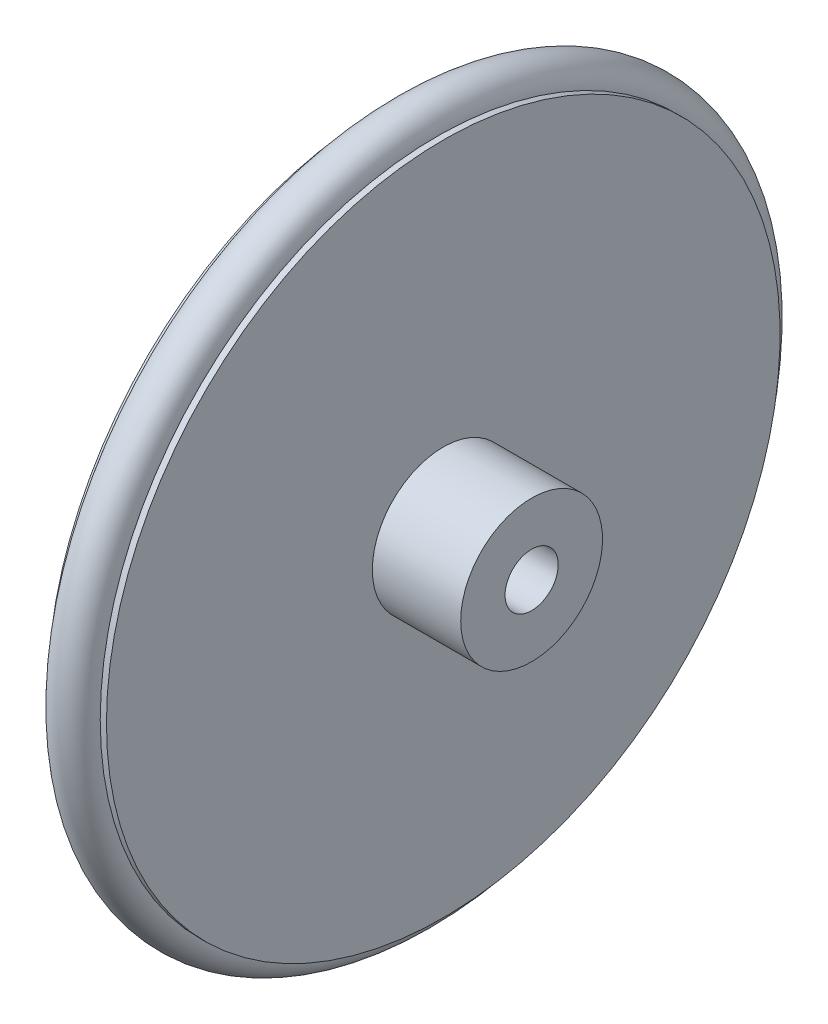
ISO-10303-21;
HEADER;
FILE_DESCRIPTION(('STEP AP214'),'2;1');
FILE_NAME('part.step','',(''),(''),'','','');
FILE_SCHEMA(('AUTOMOTIVE_DESIGN { 1 0 10303 214 1 1 1 1 }'));
ENDSEC;
DATA;
#1=APPLICATION_CONTEXT('core data for automotive mechanical design processes');
#2=APPLICATION_PROTOCOL_DEFINITION('international standard','automotive_design',2000,#1);
#3=PRODUCT_CONTEXT('',#1,'mechanical');
#4=PRODUCT('Part','Part','',(#3));
#5=PRODUCT_RELATED_PRODUCT_CATEGORY('part','',(#4));
#6=PRODUCT_DEFINITION_FORMATION('','',#4);
#7=PRODUCT_DEFINITION_CONTEXT('part definition',#1,'design');
#8=PRODUCT_DEFINITION('design','',#6,#7);
#9=PRODUCT_DEFINITION_SHAPE('','',#8);
#10=(LENGTH_UNIT() NAMED_UNIT(*) SI_UNIT(.MILLI.,.METRE.));
#11=(NAMED_UNIT(*) PLANE_ANGLE_UNIT() SI_UNIT($,.RADIAN.));
#12=(NAMED_UNIT(*) SI_UNIT($,.STERADIAN.) SOLID_ANGLE_UNIT());
#13=UNCERTAINTY_MEASURE_WITH_UNIT(LENGTH_MEASURE(1.E-05),#10,'distance_accuracy_value','');
#14=(GEOMETRIC_REPRESENTATION_CONTEXT(3) GLOBAL_UNCERTAINTY_ASSIGNED_CONTEXT((#13)) GLOBAL_UNIT_ASSIGNED_CONTEXT((#10,
#11,#12)) REPRESENTATION_CONTEXT('',''));
#15=CARTESIAN_POINT('',(0.,0.,0.));
#16=DIRECTION('',(0.,0.,1.));
#17=DIRECTION('',(1.,0.,0.));
#18=AXIS2_PLACEMENT_3D('',#15,#16,#17);
#19=CARTESIAN_POINT('',(3.30000000000003,0.,0.));
#20=DIRECTION('',(-1.,0.,0.));
#21=DIRECTION('',(0.,0.,1.));
#22=AXIS2_PLACEMENT_3D('',#19,#20,#21);
#23=TOROIDAL_SURFACE('',#22,38.,2.5);
#24=CARTESIAN_POINT('',(3.30000000000003,38.,0.));
#25=DIRECTION('',(0.,0.,1.));
#26=DIRECTION('',(1.,0.,0.));
#27=AXIS2_PLACEMENT_3D('',#24,#25,#26);
#28=CIRCLE('',#27,2.5);
#29=CARTESIAN_POINT('',(3.30000000000003,40.5,0.));
#30=VERTEX_POINT('',#29);
#31=EDGE_CURVE('E11',#30,#30,#28,.T.);
#32=CARTESIAN_POINT('',(3.30000000000003,0.,0.));
#33=DIRECTION('',(-1.,0.,0.));
#34=DIRECTION('',(0.,0.,1.));
#35=AXIS2_PLACEMENT_3D('',#32,#33,#34);
#36=CIRCLE('',#35,40.5);
#37=EDGE_CURVE('',#30,#30,#36,.T.);
#38=ORIENTED_EDGE('',*,*,#31,.F.);
#39=ORIENTED_EDGE('',*,*,#31,.T.);
#40=ORIENTED_EDGE('',*,*,#37,.T.);
#41=ORIENTED_EDGE('',*,*,#37,.F.);
#42=EDGE_LOOP('',(#38,#40,#39,#41));
#43=FACE_BOUND('',#42,.T.);
#44=ADVANCED_FACE('F44',(#43),#23,.T.);
#45=CLOSED_SHELL('',(#44));
#46=MANIFOLD_SOLID_BREP('B2',#45);
#47=CARTESIAN_POINT('',(0.,38.,0.));
#48=DIRECTION('',(1.,0.,0.));
#49=DIRECTION('',(0.,0.,-1.));
#50=AXIS2_PLACEMENT_3D('',#47,#48,#49);
#51=PLANE('',#50);
#52=CARTESIAN_POINT('',(0.,0.,0.));
#53=DIRECTION('',(1.,0.,0.));
#54=DIRECTION('',(0.,0.,-1.));
#55=AXIS2_PLACEMENT_3D('',#52,#53,#54);
#56=CIRCLE('',#55,3.);
#57=CARTESIAN_POINT('',(0.,0.,-3.));
#58=VERTEX_POINT('',#57);
#59=EDGE_CURVE('E105',#58,#58,#56,.T.);
#60=ORIENTED_EDGE('',*,*,#59,.T.);
#61=EDGE_LOOP('',(#60));
#62=FACE_BOUND('',#61,.T.);
#63=CARTESIAN_POINT('',(0.,0.,0.));
#64=DIRECTION('',(-1.,0.,0.));
#65=DIRECTION('',(0.,0.,1.));
#66=AXIS2_PLACEMENT_3D('',#63,#64,#65);
#67=CIRCLE('',#66,38.);
#68=CARTESIAN_POINT('',(0.,0.,38.));
#69=VERTEX_POINT('',#68);
#70=EDGE_CURVE('E102',#69,#69,#67,.T.);
#71=ORIENTED_EDGE('',*,*,#70,.T.);
#72=EDGE_LOOP('',(#71));
#73=FACE_BOUND('',#72,.T.);
#74=ADVANCED_FACE('F74',(#62,#73),#51,.F.);
#75=CARTESIAN_POINT('',(16.57,0.,0.));
#76=DIRECTION('',(-1.,0.,0.));
#77=DIRECTION('',(0.,0.,1.));
#78=AXIS2_PLACEMENT_3D('',#75,#76,#77);
#79=PLANE('',#78);
#80=CARTESIAN_POINT('',(16.57,0.,0.));
#81=DIRECTION('',(1.,0.,0.));
#82=DIRECTION('',(0.,0.,-1.));
#83=AXIS2_PLACEMENT_3D('',#80,#81,#82);
#84=CIRCLE('',#83,3.);
#85=CARTESIAN_POINT('',(16.57,0.,-3.));
#86=VERTEX_POINT('',#85);
#87=EDGE_CURVE('E106',#86,#86,#84,.T.);
#88=ORIENTED_EDGE('',*,*,#87,.F.);
#89=EDGE_LOOP('',(#88));
#90=FACE_BOUND('',#89,.T.);
#91=CARTESIAN_POINT('',(16.57,0.,0.));
#92=DIRECTION('',(-1.,0.,0.));
#93=DIRECTION('',(0.,0.,1.));
#94=AXIS2_PLACEMENT_3D('',#91,#92,#93);
#95=CIRCLE('',#94,8.);
#96=CARTESIAN_POINT('',(16.57,0.,8.));
#97=VERTEX_POINT('',#96);
#98=EDGE_CURVE('E43',#97,#97,#95,.T.);
#99=ORIENTED_EDGE('',*,*,#98,.F.);
#100=EDGE_LOOP('',(#99));
#101=FACE_BOUND('',#100,.T.);
#102=ADVANCED_FACE('F121',(#90,#101),#79,.F.);
#103=CARTESIAN_POINT('',(-19.9450853035614,0.,0.));
#104=DIRECTION('',(-1.,0.,0.));
#105=DIRECTION('',(0.,0.,1.));
#106=AXIS2_PLACEMENT_3D('',#103,#104,#105);
#107=CYLINDRICAL_SURFACE('',#106,8.);
#108=CARTESIAN_POINT('',(6.6,0.,0.));
#109=DIRECTION('',(-1.,0.,0.));
#110=DIRECTION('',(0.,0.,1.));
#111=AXIS2_PLACEMENT_3D('',#108,#109,#110);
#112=CIRCLE('',#111,8.);
#113=CARTESIAN_POINT('',(6.6,0.,8.));
#114=VERTEX_POINT('',#113);
#115=EDGE_CURVE('E80',#114,#114,#112,.T.);
#116=ORIENTED_EDGE('',*,*,#115,.F.);
#117=EDGE_LOOP('',(#116));
#118=FACE_BOUND('',#117,.T.);
#119=ORIENTED_EDGE('',*,*,#98,.T.);
#120=EDGE_LOOP('',(#119));
#121=FACE_BOUND('',#120,.T.);
#122=ADVANCED_FACE('F124',(#118,#121),#107,.T.);
#123=CARTESIAN_POINT('',(6.6,8.,0.));
#124=DIRECTION('',(-1.,0.,0.));
#125=DIRECTION('',(0.,0.,1.));
#126=AXIS2_PLACEMENT_3D('',#123,#124,#125);
#127=PLANE('',#126);
#128=CARTESIAN_POINT('',(6.6,0.,0.));
#129=DIRECTION('',(-1.,0.,0.));
#130=DIRECTION('',(0.,0.,1.));
#131=AXIS2_PLACEMENT_3D('',#128,#129,#130);
#132=CIRCLE('',#131,38.);
#133=CARTESIAN_POINT('',(6.6,0.,38.));
#134=VERTEX_POINT('',#133);
#135=EDGE_CURVE('E84',#134,#134,#132,.T.);
#136=ORIENTED_EDGE('',*,*,#135,.F.);
#137=EDGE_LOOP('',(#136));
#138=FACE_BOUND('',#137,.T.);
#139=ORIENTED_EDGE('',*,*,#115,.T.);
#140=EDGE_LOOP('',(#139));
#141=FACE_BOUND('',#140,.T.);
#142=ADVANCED_FACE('F129',(#138,#141),#127,.F.);
#143=CARTESIAN_POINT('',(-19.9450853035614,0.,0.));
#144=DIRECTION('',(-1.,0.,0.));
#145=DIRECTION('',(0.,0.,1.));
#146=AXIS2_PLACEMENT_3D('',#143,#144,#145);
#147=CYLINDRICAL_SURFACE('',#146,38.);
#148=CARTESIAN_POINT('',(5.9,0.,0.));
#149=DIRECTION('',(-1.,0.,0.));
#150=DIRECTION('',(0.,0.,1.));
#151=AXIS2_PLACEMENT_3D('',#148,#149,#150);
#152=CIRCLE('',#151,38.);
#153=CARTESIAN_POINT('',(5.9,0.,38.));
#154=VERTEX_POINT('',#153);
#155=EDGE_CURVE('E88',#154,#154,#152,.T.);
#156=ORIENTED_EDGE('',*,*,#155,.F.);
#157=EDGE_LOOP('',(#156));
#158=FACE_BOUND('',#157,.T.);
#159=ORIENTED_EDGE('',*,*,#135,.T.);
#160=EDGE_LOOP('',(#159));
#161=FACE_BOUND('',#160,.T.);
#162=ADVANCED_FACE('F135',(#158,#161),#147,.T.);
#163=CARTESIAN_POINT('',(5.90000000000003,38.,0.));
#164=DIRECTION('',(1.,0.,0.));
#165=DIRECTION('',(0.,0.,-1.));
#166=AXIS2_PLACEMENT_3D('',#163,#164,#165);
#167=PLANE('',#166);
#168=CARTESIAN_POINT('',(5.90000000000004,0.,0.));
#169=DIRECTION('',(-1.,0.,0.));
#170=DIRECTION('',(0.,0.,1.));
#171=AXIS2_PLACEMENT_3D('',#168,#169,#170);
#172=CIRCLE('',#171,35.);
#173=CARTESIAN_POINT('',(5.90000000000004,0.,35.));
#174=VERTEX_POINT('',#173);
#175=EDGE_CURVE('E93',#174,#174,#172,.T.);
#176=ORIENTED_EDGE('',*,*,#175,.F.);
#177=EDGE_LOOP('',(#176));
#178=FACE_BOUND('',#177,.T.);
#179=ORIENTED_EDGE('',*,*,#155,.T.);
#180=EDGE_LOOP('',(#179));
#181=FACE_BOUND('',#180,.T.);
#182=ADVANCED_FACE('F139',(#178,#181),#167,.F.);
#183=CARTESIAN_POINT('',(-19.9450853035614,0.,0.));
#184=DIRECTION('',(-1.,0.,0.));
#185=DIRECTION('',(0.,0.,1.));
#186=AXIS2_PLACEMENT_3D('',#183,#184,#185);
#187=CYLINDRICAL_SURFACE('',#186,35.);
#188=CARTESIAN_POINT('',(0.700000000000041,0.,0.));
#189=DIRECTION('',(-1.,0.,0.));
#190=DIRECTION('',(0.,0.,1.));
#191=AXIS2_PLACEMENT_3D('',#188,#189,#190);
#192=CIRCLE('',#191,35.);
#193=CARTESIAN_POINT('',(0.700000000000041,0.,35.));
#194=VERTEX_POINT('',#193);
#195=EDGE_CURVE('E96',#194,#194,#192,.T.);
#196=ORIENTED_EDGE('',*,*,#195,.F.);
#197=EDGE_LOOP('',(#196));
#198=FACE_BOUND('',#197,.T.);
#199=ORIENTED_EDGE('',*,*,#175,.T.);
#200=EDGE_LOOP('',(#199));
#201=FACE_BOUND('',#200,.T.);
#202=ADVANCED_FACE('F143',(#198,#201),#187,.T.);
#203=CARTESIAN_POINT('',(0.700000000000042,35.,0.));
#204=DIRECTION('',(-1.,0.,0.));
#205=DIRECTION('',(0.,0.,1.));
#206=AXIS2_PLACEMENT_3D('',#203,#204,#205);
#207=PLANE('',#206);
#208=CARTESIAN_POINT('',(0.700000000000041,0.,0.));
#209=DIRECTION('',(-1.,0.,0.));
#210=DIRECTION('',(0.,0.,1.));
#211=AXIS2_PLACEMENT_3D('',#208,#209,#210);
#212=CIRCLE('',#211,38.);
#213=CARTESIAN_POINT('',(0.700000000000041,0.,38.));
#214=VERTEX_POINT('',#213);
#215=EDGE_CURVE('E99',#214,#214,#212,.T.);
#216=ORIENTED_EDGE('',*,*,#215,.F.);
#217=EDGE_LOOP('',(#216));
#218=FACE_BOUND('',#217,.T.);
#219=ORIENTED_EDGE('',*,*,#195,.T.);
#220=EDGE_LOOP('',(#219));
#221=FACE_BOUND('',#220,.T.);
#222=ADVANCED_FACE('F147',(#218,#221),#207,.F.);
#223=CARTESIAN_POINT('',(-19.9450853035614,0.,0.));
#224=DIRECTION('',(-1.,0.,0.));
#225=DIRECTION('',(0.,0.,1.));
#226=AXIS2_PLACEMENT_3D('',#223,#224,#225);
#227=CYLINDRICAL_SURFACE('',#226,38.);
#228=ORIENTED_EDGE('',*,*,#70,.F.);
#229=EDGE_LOOP('',(#228));
#230=FACE_BOUND('',#229,.T.);
#231=ORIENTED_EDGE('',*,*,#215,.T.);
#232=EDGE_LOOP('',(#231));
#233=FACE_BOUND('',#232,.T.);
#234=ADVANCED_FACE('F117',(#230,#233),#227,.T.);
#235=CARTESIAN_POINT('',(0.,0.,0.));
#236=DIRECTION('',(1.,0.,0.));
#237=DIRECTION('',(0.,0.,-1.));
#238=AXIS2_PLACEMENT_3D('',#235,#236,#237);
#239=CYLINDRICAL_SURFACE('',#238,3.);
#240=ORIENTED_EDGE('',*,*,#59,.F.);
#241=EDGE_LOOP('',(#240));
#242=FACE_BOUND('',#241,.T.);
#243=ORIENTED_EDGE('',*,*,#87,.T.);
#244=EDGE_LOOP('',(#243));
#245=FACE_BOUND('',#244,.T.);
#246=ADVANCED_FACE('F114',(#242,#245),#239,.F.);
#247=CLOSED_SHELL('',(#74,#102,#122,#142,#162,#182,#202,#222,#234,#246));
#248=MANIFOLD_SOLID_BREP('B6',#247);
#249=ADVANCED_BREP_SHAPE_REPRESENTATION('',(#18,#46,#248),#14);
#250=SHAPE_DEFINITION_REPRESENTATION(#9,#249);
ENDSEC;
END-ISO-10303-21;
